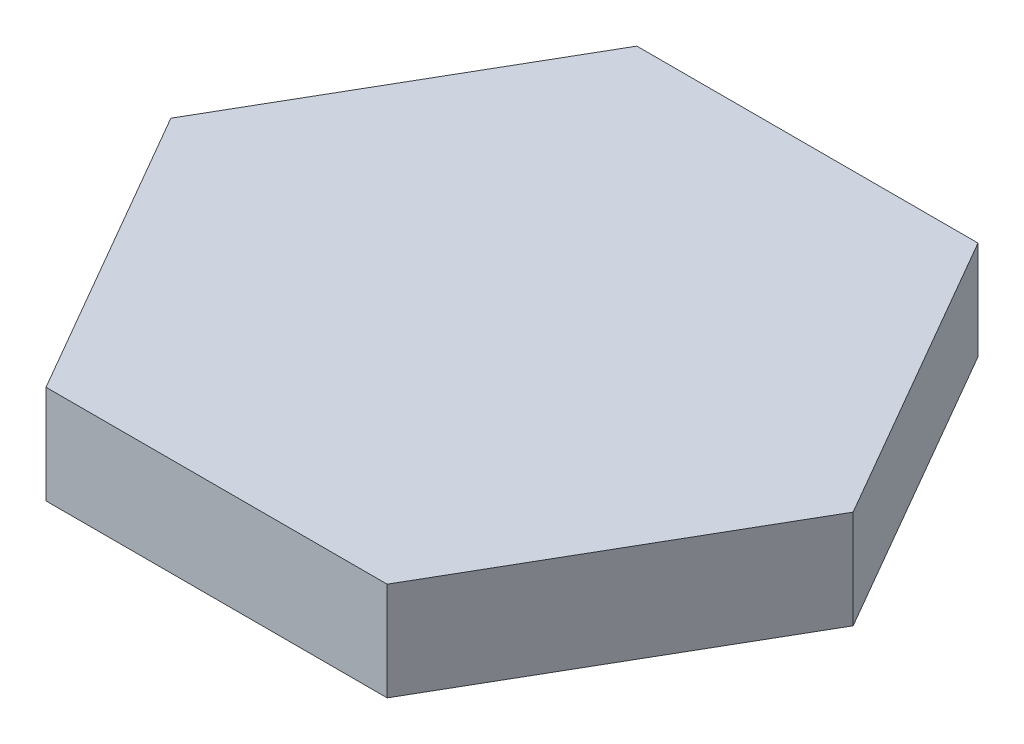
ISO-10303-21;
HEADER;
FILE_DESCRIPTION(('STEP AP214'),'2;1');
FILE_NAME('part.step','',(''),(''),'','','');
FILE_SCHEMA(('AUTOMOTIVE_DESIGN { 1 0 10303 214 1 1 1 1 }'));
ENDSEC;
DATA;
#1=APPLICATION_CONTEXT('core data for automotive mechanical design processes');
#2=APPLICATION_PROTOCOL_DEFINITION('international standard','automotive_design',2000,#1);
#3=PRODUCT_CONTEXT('',#1,'mechanical');
#4=PRODUCT('Part','Part','',(#3));
#5=PRODUCT_RELATED_PRODUCT_CATEGORY('part','',(#4));
#6=PRODUCT_DEFINITION_FORMATION('','',#4);
#7=PRODUCT_DEFINITION_CONTEXT('part definition',#1,'design');
#8=PRODUCT_DEFINITION('design','',#6,#7);
#9=PRODUCT_DEFINITION_SHAPE('','',#8);
#10=(LENGTH_UNIT() NAMED_UNIT(*) SI_UNIT(.MILLI.,.METRE.));
#11=(NAMED_UNIT(*) PLANE_ANGLE_UNIT() SI_UNIT($,.RADIAN.));
#12=(NAMED_UNIT(*) SI_UNIT($,.STERADIAN.) SOLID_ANGLE_UNIT());
#13=UNCERTAINTY_MEASURE_WITH_UNIT(LENGTH_MEASURE(1.E-05),#10,'distance_accuracy_value','');
#14=(GEOMETRIC_REPRESENTATION_CONTEXT(3) GLOBAL_UNCERTAINTY_ASSIGNED_CONTEXT((#13)) GLOBAL_UNIT_ASSIGNED_CONTEXT((#10,
#11,#12)) REPRESENTATION_CONTEXT('',''));
#15=CARTESIAN_POINT('',(0.,0.,0.));
#16=DIRECTION('',(0.,0.,1.));
#17=DIRECTION('',(1.,0.,0.));
#18=AXIS2_PLACEMENT_3D('',#15,#16,#17);
#19=CARTESIAN_POINT('',(10.3923048454133,3.,0.));
#20=DIRECTION('',(-0.866025403784438,0.,0.500000000000001));
#21=DIRECTION('',(0.500000000000001,0.,0.866025403784438));
#22=AXIS2_PLACEMENT_3D('',#19,#20,#21);
#23=PLANE('',#22);
#24=DIRECTION('',(-0.5,0.,-0.866025403784438));
#25=VECTOR('',#24,1.);
#26=CARTESIAN_POINT('',(10.3923048454133,0.,0.));
#27=LINE('',#26,#25);
#28=CARTESIAN_POINT('',(10.3923048454133,0.,0.));
#29=VERTEX_POINT('',#28);
#30=CARTESIAN_POINT('',(5.19615242270663,0.,-9.));
#31=VERTEX_POINT('',#30);
#32=EDGE_CURVE('E128',#29,#31,#27,.T.);
#33=ORIENTED_EDGE('',*,*,#32,.T.);
#34=DIRECTION('',(0.,-1.,0.));
#35=VECTOR('',#34,1.);
#36=CARTESIAN_POINT('',(5.19615242270663,3.,-9.));
#37=LINE('',#36,#35);
#38=CARTESIAN_POINT('',(5.19615242270663,3.,-9.));
#39=VERTEX_POINT('',#38);
#40=EDGE_CURVE('E11',#39,#31,#37,.T.);
#41=ORIENTED_EDGE('',*,*,#40,.F.);
#42=DIRECTION('',(-0.5,0.,-0.866025403784438));
#43=VECTOR('',#42,1.);
#44=CARTESIAN_POINT('',(10.3923048454133,3.,0.));
#45=LINE('',#44,#43);
#46=CARTESIAN_POINT('',(10.3923048454133,3.,0.));
#47=VERTEX_POINT('',#46);
#48=EDGE_CURVE('E144',#47,#39,#45,.T.);
#49=ORIENTED_EDGE('',*,*,#48,.F.);
#50=DIRECTION('',(0.,-1.,0.));
#51=VECTOR('',#50,1.);
#52=CARTESIAN_POINT('',(10.3923048454133,3.,0.));
#53=LINE('',#52,#51);
#54=EDGE_CURVE('E124',#47,#29,#53,.T.);
#55=ORIENTED_EDGE('',*,*,#54,.T.);
#56=EDGE_LOOP('',(#33,#41,#49,#55));
#57=FACE_BOUND('',#56,.T.);
#58=ADVANCED_FACE('F39',(#57),#23,.F.);
#59=CARTESIAN_POINT('',(5.19615242270663,3.,-9.));
#60=DIRECTION('',(0.,0.,1.));
#61=DIRECTION('',(1.,0.,0.));
#62=AXIS2_PLACEMENT_3D('',#59,#60,#61);
#63=PLANE('',#62);
#64=DIRECTION('',(-1.,0.,0.));
#65=VECTOR('',#64,1.);
#66=CARTESIAN_POINT('',(5.19615242270663,0.,-9.));
#67=LINE('',#66,#65);
#68=CARTESIAN_POINT('',(-5.19615242270663,0.,-9.));
#69=VERTEX_POINT('',#68);
#70=EDGE_CURVE('E132',#31,#69,#67,.T.);
#71=ORIENTED_EDGE('',*,*,#70,.T.);
#72=DIRECTION('',(0.,-1.,0.));
#73=VECTOR('',#72,1.);
#74=CARTESIAN_POINT('',(-5.19615242270663,3.,-9.));
#75=LINE('',#74,#73);
#76=CARTESIAN_POINT('',(-5.19615242270663,3.,-9.));
#77=VERTEX_POINT('',#76);
#78=EDGE_CURVE('E48',#77,#69,#75,.T.);
#79=ORIENTED_EDGE('',*,*,#78,.F.);
#80=DIRECTION('',(-1.,0.,0.));
#81=VECTOR('',#80,1.);
#82=CARTESIAN_POINT('',(5.19615242270663,3.,-9.));
#83=LINE('',#82,#81);
#84=EDGE_CURVE('E93',#39,#77,#83,.T.);
#85=ORIENTED_EDGE('',*,*,#84,.F.);
#86=ORIENTED_EDGE('',*,*,#40,.T.);
#87=EDGE_LOOP('',(#71,#79,#85,#86));
#88=FACE_BOUND('',#87,.T.);
#89=ADVANCED_FACE('F172',(#88),#63,.F.);
#90=CARTESIAN_POINT('',(-5.19615242270663,3.,-9.));
#91=DIRECTION('',(0.866025403784439,0.,0.5));
#92=DIRECTION('',(0.5,0.,-0.866025403784439));
#93=AXIS2_PLACEMENT_3D('',#90,#91,#92);
#94=PLANE('',#93);
#95=DIRECTION('',(-0.499999999999999,0.,0.866025403784439));
#96=VECTOR('',#95,1.);
#97=CARTESIAN_POINT('',(-5.19615242270663,0.,-9.));
#98=LINE('',#97,#96);
#99=CARTESIAN_POINT('',(-10.3923048454133,0.,0.));
#100=VERTEX_POINT('',#99);
#101=EDGE_CURVE('E135',#69,#100,#98,.T.);
#102=ORIENTED_EDGE('',*,*,#101,.T.);
#103=DIRECTION('',(0.,-1.,0.));
#104=VECTOR('',#103,1.);
#105=CARTESIAN_POINT('',(-10.3923048454133,3.,0.));
#106=LINE('',#105,#104);
#107=CARTESIAN_POINT('',(-10.3923048454133,3.,0.));
#108=VERTEX_POINT('',#107);
#109=EDGE_CURVE('E117',#108,#100,#106,.T.);
#110=ORIENTED_EDGE('',*,*,#109,.F.);
#111=DIRECTION('',(-0.499999999999999,0.,0.866025403784439));
#112=VECTOR('',#111,1.);
#113=CARTESIAN_POINT('',(-5.19615242270663,3.,-9.));
#114=LINE('',#113,#112);
#115=EDGE_CURVE('E106',#77,#108,#114,.T.);
#116=ORIENTED_EDGE('',*,*,#115,.F.);
#117=ORIENTED_EDGE('',*,*,#78,.T.);
#118=EDGE_LOOP('',(#102,#110,#116,#117));
#119=FACE_BOUND('',#118,.T.);
#120=ADVANCED_FACE('F154',(#119),#94,.F.);
#121=CARTESIAN_POINT('',(-10.3923048454133,3.,0.));
#122=DIRECTION('',(0.866025403784438,0.,-0.5));
#123=DIRECTION('',(-0.5,0.,-0.866025403784439));
#124=AXIS2_PLACEMENT_3D('',#121,#122,#123);
#125=PLANE('',#124);
#126=DIRECTION('',(0.5,0.,0.866025403784439));
#127=VECTOR('',#126,1.);
#128=CARTESIAN_POINT('',(-10.3923048454133,0.,0.));
#129=LINE('',#128,#127);
#130=CARTESIAN_POINT('',(-5.19615242270662,0.,9.00000000000001));
#131=VERTEX_POINT('',#130);
#132=EDGE_CURVE('E115',#100,#131,#129,.T.);
#133=ORIENTED_EDGE('',*,*,#132,.T.);
#134=DIRECTION('',(0.,-1.,0.));
#135=VECTOR('',#134,1.);
#136=CARTESIAN_POINT('',(-5.19615242270662,3.,9.00000000000001));
#137=LINE('',#136,#135);
#138=CARTESIAN_POINT('',(-5.19615242270662,3.,9.00000000000001));
#139=VERTEX_POINT('',#138);
#140=EDGE_CURVE('E112',#139,#131,#137,.T.);
#141=ORIENTED_EDGE('',*,*,#140,.F.);
#142=DIRECTION('',(0.5,0.,0.866025403784439));
#143=VECTOR('',#142,1.);
#144=CARTESIAN_POINT('',(-10.3923048454133,3.,0.));
#145=LINE('',#144,#143);
#146=EDGE_CURVE('E100',#108,#139,#145,.T.);
#147=ORIENTED_EDGE('',*,*,#146,.F.);
#148=ORIENTED_EDGE('',*,*,#109,.T.);
#149=EDGE_LOOP('',(#133,#141,#147,#148));
#150=FACE_BOUND('',#149,.T.);
#151=ADVANCED_FACE('F113',(#150),#125,.F.);
#152=CARTESIAN_POINT('',(-5.19615242270662,3.,9.00000000000001));
#153=DIRECTION('',(0.,0.,-1.));
#154=DIRECTION('',(-1.,0.,0.));
#155=AXIS2_PLACEMENT_3D('',#152,#153,#154);
#156=PLANE('',#155);
#157=DIRECTION('',(1.,0.,0.));
#158=VECTOR('',#157,1.);
#159=CARTESIAN_POINT('',(-5.19615242270662,0.,9.00000000000001));
#160=LINE('',#159,#158);
#161=CARTESIAN_POINT('',(5.19615242270664,0.,9.));
#162=VERTEX_POINT('',#161);
#163=EDGE_CURVE('E79',#131,#162,#160,.T.);
#164=ORIENTED_EDGE('',*,*,#163,.T.);
#165=DIRECTION('',(0.,-1.,0.));
#166=VECTOR('',#165,1.);
#167=CARTESIAN_POINT('',(5.19615242270664,3.,9.));
#168=LINE('',#167,#166);
#169=CARTESIAN_POINT('',(5.19615242270664,3.,9.));
#170=VERTEX_POINT('',#169);
#171=EDGE_CURVE('E118',#170,#162,#168,.T.);
#172=ORIENTED_EDGE('',*,*,#171,.F.);
#173=DIRECTION('',(1.,0.,0.));
#174=VECTOR('',#173,1.);
#175=CARTESIAN_POINT('',(-5.19615242270662,3.,9.00000000000001));
#176=LINE('',#175,#174);
#177=EDGE_CURVE('E104',#139,#170,#176,.T.);
#178=ORIENTED_EDGE('',*,*,#177,.F.);
#179=ORIENTED_EDGE('',*,*,#140,.T.);
#180=EDGE_LOOP('',(#164,#172,#178,#179));
#181=FACE_BOUND('',#180,.T.);
#182=ADVANCED_FACE('F120',(#181),#156,.F.);
#183=CARTESIAN_POINT('',(5.19615242270664,3.,9.));
#184=DIRECTION('',(-0.866025403784439,0.,-0.5));
#185=DIRECTION('',(-0.5,0.,0.866025403784439));
#186=AXIS2_PLACEMENT_3D('',#183,#184,#185);
#187=PLANE('',#186);
#188=DIRECTION('',(0.5,0.,-0.866025403784439));
#189=VECTOR('',#188,1.);
#190=CARTESIAN_POINT('',(5.19615242270664,0.,9.));
#191=LINE('',#190,#189);
#192=EDGE_CURVE('E85',#162,#29,#191,.T.);
#193=ORIENTED_EDGE('',*,*,#192,.T.);
#194=ORIENTED_EDGE('',*,*,#54,.F.);
#195=DIRECTION('',(0.5,0.,-0.866025403784439));
#196=VECTOR('',#195,1.);
#197=CARTESIAN_POINT('',(5.19615242270664,3.,9.));
#198=LINE('',#197,#196);
#199=EDGE_CURVE('E56',#170,#47,#198,.T.);
#200=ORIENTED_EDGE('',*,*,#199,.F.);
#201=ORIENTED_EDGE('',*,*,#171,.T.);
#202=EDGE_LOOP('',(#193,#194,#200,#201));
#203=FACE_BOUND('',#202,.T.);
#204=ADVANCED_FACE('F161',(#203),#187,.F.);
#205=CARTESIAN_POINT('',(0.,3.,0.));
#206=DIRECTION('',(0.,1.,0.));
#207=DIRECTION('',(0.,0.,1.));
#208=AXIS2_PLACEMENT_3D('',#205,#206,#207);
#209=PLANE('',#208);
#210=ORIENTED_EDGE('',*,*,#48,.T.);
#211=ORIENTED_EDGE('',*,*,#84,.T.);
#212=ORIENTED_EDGE('',*,*,#115,.T.);
#213=ORIENTED_EDGE('',*,*,#146,.T.);
#214=ORIENTED_EDGE('',*,*,#177,.T.);
#215=ORIENTED_EDGE('',*,*,#199,.T.);
#216=EDGE_LOOP('',(#210,#211,#212,#213,#214,#215));
#217=FACE_BOUND('',#216,.T.);
#218=ADVANCED_FACE('F102',(#217),#209,.T.);
#219=CARTESIAN_POINT('',(0.,0.,0.));
#220=DIRECTION('',(0.,1.,0.));
#221=DIRECTION('',(0.,0.,1.));
#222=AXIS2_PLACEMENT_3D('',#219,#220,#221);
#223=PLANE('',#222);
#224=ORIENTED_EDGE('',*,*,#32,.F.);
#225=ORIENTED_EDGE('',*,*,#192,.F.);
#226=ORIENTED_EDGE('',*,*,#163,.F.);
#227=ORIENTED_EDGE('',*,*,#132,.F.);
#228=ORIENTED_EDGE('',*,*,#101,.F.);
#229=ORIENTED_EDGE('',*,*,#70,.F.);
#230=EDGE_LOOP('',(#224,#225,#226,#227,#228,#229));
#231=FACE_BOUND('',#230,.T.);
#232=ADVANCED_FACE('F157',(#231),#223,.F.);
#233=CLOSED_SHELL('',(#58,#89,#120,#151,#182,#204,#218,#232));
#234=MANIFOLD_SOLID_BREP('B2',#233);
#235=ADVANCED_BREP_SHAPE_REPRESENTATION('',(#18,#234),#14);
#236=SHAPE_DEFINITION_REPRESENTATION(#9,#235);
ENDSEC;
END-ISO-10303-21;
